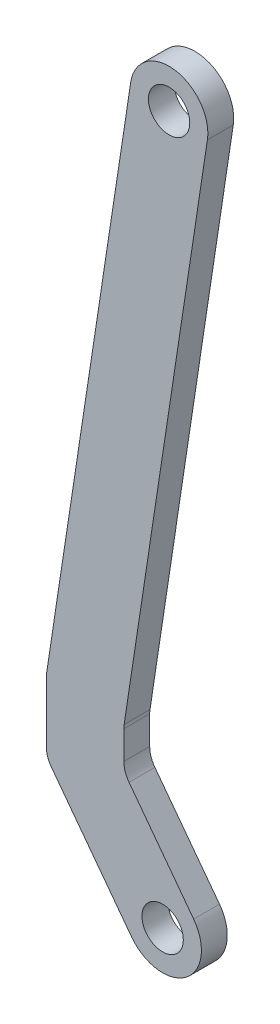
ISO-10303-21;
HEADER;
FILE_DESCRIPTION(('STEP AP214'),'2;1');
FILE_NAME('part.step','',(''),(''),'','','');
FILE_SCHEMA(('AUTOMOTIVE_DESIGN { 1 0 10303 214 1 1 1 1 }'));
ENDSEC;
DATA;
#1=APPLICATION_CONTEXT('core data for automotive mechanical design processes');
#2=APPLICATION_PROTOCOL_DEFINITION('international standard','automotive_design',2000,#1);
#3=PRODUCT_CONTEXT('',#1,'mechanical');
#4=PRODUCT('Part','Part','',(#3));
#5=PRODUCT_RELATED_PRODUCT_CATEGORY('part','',(#4));
#6=PRODUCT_DEFINITION_FORMATION('','',#4);
#7=PRODUCT_DEFINITION_CONTEXT('part definition',#1,'design');
#8=PRODUCT_DEFINITION('design','',#6,#7);
#9=PRODUCT_DEFINITION_SHAPE('','',#8);
#10=(LENGTH_UNIT() NAMED_UNIT(*) SI_UNIT(.MILLI.,.METRE.));
#11=(NAMED_UNIT(*) PLANE_ANGLE_UNIT() SI_UNIT($,.RADIAN.));
#12=(NAMED_UNIT(*) SI_UNIT($,.STERADIAN.) SOLID_ANGLE_UNIT());
#13=UNCERTAINTY_MEASURE_WITH_UNIT(LENGTH_MEASURE(1.E-05),#10,'distance_accuracy_value','');
#14=(GEOMETRIC_REPRESENTATION_CONTEXT(3) GLOBAL_UNCERTAINTY_ASSIGNED_CONTEXT((#13)) GLOBAL_UNIT_ASSIGNED_CONTEXT((#10,
#11,#12)) REPRESENTATION_CONTEXT('',''));
#15=CARTESIAN_POINT('',(0.,0.,0.));
#16=DIRECTION('',(0.,0.,1.));
#17=DIRECTION('',(1.,0.,0.));
#18=AXIS2_PLACEMENT_3D('',#15,#16,#17);
#19=CARTESIAN_POINT('',(-20.5,45.6407740281266,2.));
#20=DIRECTION('',(0.,0.,1.));
#21=DIRECTION('',(1.,0.,0.));
#22=AXIS2_PLACEMENT_3D('',#19,#20,#21);
#23=PLANE('',#22);
#24=CARTESIAN_POINT('',(-21.,-9.35695319764157,2.));
#25=DIRECTION('',(0.,0.,1.));
#26=DIRECTION('',(1.,0.,0.));
#27=AXIS2_PLACEMENT_3D('',#24,#25,#26);
#28=CIRCLE('',#27,1.6);
#29=CARTESIAN_POINT('',(-19.4,-9.35695319764157,2.));
#30=VERTEX_POINT('',#29);
#31=EDGE_CURVE('E183',#30,#30,#28,.T.);
#32=ORIENTED_EDGE('',*,*,#31,.F.);
#33=EDGE_LOOP('',(#32));
#34=FACE_BOUND('',#33,.T.);
#35=DIRECTION('',(-0.150246774783861,-0.988648525345104,0.));
#36=VECTOR('',#35,1.);
#37=CARTESIAN_POINT('',(-23.4659455760353,46.0915143524782,2.));
#38=LINE('',#37,#36);
#39=CARTESIAN_POINT('',(-23.4659455760353,46.0915143524782,2.));
#40=VERTEX_POINT('',#39);
#41=CARTESIAN_POINT('',(-29.9772970506902,3.24574915930261,2.));
#42=VERTEX_POINT('',#41);
#43=EDGE_CURVE('E158',#40,#42,#38,.T.);
#44=ORIENTED_EDGE('',*,*,#43,.T.);
#45=CARTESIAN_POINT('',(-28.,2.94525560973489,2.));
#46=DIRECTION('',(0.,0.,1.));
#47=DIRECTION('',(1.,0.,0.));
#48=AXIS2_PLACEMENT_3D('',#45,#46,#47);
#49=CIRCLE('',#48,2.);
#50=CARTESIAN_POINT('',(-30.,2.94525560973489,2.));
#51=VERTEX_POINT('',#50);
#52=EDGE_CURVE('E244',#42,#51,#49,.T.);
#53=ORIENTED_EDGE('',*,*,#52,.T.);
#54=DIRECTION('',(0.,-1.,0.));
#55=VECTOR('',#54,1.);
#56=CARTESIAN_POINT('',(-30.,3.0963600134231,2.));
#57=LINE('',#56,#55);
#58=CARTESIAN_POINT('',(-30.,-1.6902865309749,2.));
#59=VERTEX_POINT('',#58);
#60=EDGE_CURVE('E162',#51,#59,#57,.T.);
#61=ORIENTED_EDGE('',*,*,#60,.T.);
#62=CARTESIAN_POINT('',(-28.,-1.6902865309749,2.));
#63=DIRECTION('',(0.,0.,1.));
#64=DIRECTION('',(1.,0.,0.));
#65=AXIS2_PLACEMENT_3D('',#62,#63,#64);
#66=CIRCLE('',#65,2.);
#67=CARTESIAN_POINT('',(-29.6,-2.8902865309749,2.));
#68=VERTEX_POINT('',#67);
#69=EDGE_CURVE('E55',#59,#68,#66,.T.);
#70=ORIENTED_EDGE('',*,*,#69,.T.);
#71=DIRECTION('',(0.600000000000002,-0.799999999999998,0.));
#72=VECTOR('',#71,1.);
#73=CARTESIAN_POINT('',(-28.8,-3.95695319764155,2.));
#74=LINE('',#73,#72);
#75=CARTESIAN_POINT('',(-23.4,-11.1569531976416,2.));
#76=VERTEX_POINT('',#75);
#77=EDGE_CURVE('E168',#68,#76,#74,.T.);
#78=ORIENTED_EDGE('',*,*,#77,.T.);
#79=CARTESIAN_POINT('',(-21.,-9.35695319764157,2.));
#80=DIRECTION('',(0.,0.,1.));
#81=DIRECTION('',(-1.,0.,0.));
#82=AXIS2_PLACEMENT_3D('',#79,#80,#81);
#83=CIRCLE('',#82,3.);
#84=CARTESIAN_POINT('',(-18.6,-7.55695319764156,2.));
#85=VERTEX_POINT('',#84);
#86=EDGE_CURVE('E171',#76,#85,#83,.T.);
#87=ORIENTED_EDGE('',*,*,#86,.T.);
#88=DIRECTION('',(-0.6,0.8,0.));
#89=VECTOR('',#88,1.);
#90=CARTESIAN_POINT('',(-24.,-0.356953197641568,2.));
#91=LINE('',#90,#89);
#92=CARTESIAN_POINT('',(-23.6,-0.890286530974903,2.));
#93=VERTEX_POINT('',#92);
#94=EDGE_CURVE('E174',#85,#93,#91,.T.);
#95=ORIENTED_EDGE('',*,*,#94,.T.);
#96=CARTESIAN_POINT('',(-22.,0.309713469025098,2.));
#97=DIRECTION('',(0.,0.,1.));
#98=DIRECTION('',(1.,0.,0.));
#99=AXIS2_PLACEMENT_3D('',#96,#97,#98);
#100=CIRCLE('',#99,2.);
#101=CARTESIAN_POINT('',(-24.,0.309713469025098,2.));
#102=VERTEX_POINT('',#101);
#103=EDGE_CURVE('E11',#93,#102,#100,.F.);
#104=ORIENTED_EDGE('',*,*,#103,.T.);
#105=DIRECTION('',(0.,1.,0.));
#106=VECTOR('',#105,1.);
#107=CARTESIAN_POINT('',(-24.,-0.356953197641568,2.));
#108=LINE('',#107,#106);
#109=CARTESIAN_POINT('',(-24.,2.49194239867023,2.));
#110=VERTEX_POINT('',#109);
#111=EDGE_CURVE('E142',#102,#110,#108,.T.);
#112=ORIENTED_EDGE('',*,*,#111,.T.);
#113=CARTESIAN_POINT('',(-22.,2.49194239867023,2.));
#114=DIRECTION('',(0.,0.,1.));
#115=DIRECTION('',(1.,0.,0.));
#116=AXIS2_PLACEMENT_3D('',#113,#114,#115);
#117=CIRCLE('',#116,2.);
#118=CARTESIAN_POINT('',(-23.9772970506902,2.79243594823796,2.));
#119=VERTEX_POINT('',#118);
#120=EDGE_CURVE('E137',#110,#119,#117,.F.);
#121=ORIENTED_EDGE('',*,*,#120,.T.);
#122=DIRECTION('',(0.150246774783861,0.988648525345104,0.));
#123=VECTOR('',#122,1.);
#124=CARTESIAN_POINT('',(-17.5340544239647,45.190033703775,2.));
#125=LINE('',#124,#123);
#126=CARTESIAN_POINT('',(-17.5340544239647,45.190033703775,2.));
#127=VERTEX_POINT('',#126);
#128=EDGE_CURVE('E129',#119,#127,#125,.T.);
#129=ORIENTED_EDGE('',*,*,#128,.T.);
#130=CARTESIAN_POINT('',(-20.5,45.6407740281266,2.));
#131=DIRECTION('',(0.,0.,1.));
#132=DIRECTION('',(1.,0.,0.));
#133=AXIS2_PLACEMENT_3D('',#130,#131,#132);
#134=CIRCLE('',#133,3.);
#135=EDGE_CURVE('E133',#127,#40,#134,.T.);
#136=ORIENTED_EDGE('',*,*,#135,.T.);
#137=EDGE_LOOP('',(#44,#53,#61,#70,#78,#87,#95,#104,#112,#121,#129,#136));
#138=FACE_BOUND('',#137,.T.);
#139=CARTESIAN_POINT('',(-20.5,45.6407740281266,2.));
#140=DIRECTION('',(0.,0.,1.));
#141=DIRECTION('',(1.,0.,0.));
#142=AXIS2_PLACEMENT_3D('',#139,#140,#141);
#143=CIRCLE('',#142,1.6);
#144=CARTESIAN_POINT('',(-18.9,45.6407740281266,2.));
#145=VERTEX_POINT('',#144);
#146=EDGE_CURVE('E284',#145,#145,#143,.T.);
#147=ORIENTED_EDGE('',*,*,#146,.F.);
#148=EDGE_LOOP('',(#147));
#149=FACE_BOUND('',#148,.T.);
#150=ADVANCED_FACE('F39',(#34,#138,#149),#23,.T.);
#151=CARTESIAN_POINT('',(-20.5,45.6407740281266,0.));
#152=DIRECTION('',(0.,0.,1.));
#153=DIRECTION('',(1.,0.,0.));
#154=AXIS2_PLACEMENT_3D('',#151,#152,#153);
#155=PLANE('',#154);
#156=DIRECTION('',(0.,-1.,0.));
#157=VECTOR('',#156,1.);
#158=CARTESIAN_POINT('',(-30.,3.0963600134231,0.));
#159=LINE('',#158,#157);
#160=CARTESIAN_POINT('',(-30.,2.94525560973489,0.));
#161=VERTEX_POINT('',#160);
#162=CARTESIAN_POINT('',(-30.,-1.6902865309749,0.));
#163=VERTEX_POINT('',#162);
#164=EDGE_CURVE('E192',#161,#163,#159,.T.);
#165=ORIENTED_EDGE('',*,*,#164,.F.);
#166=CARTESIAN_POINT('',(-28.,2.94525560973489,0.));
#167=DIRECTION('',(0.,0.,1.));
#168=DIRECTION('',(1.,0.,0.));
#169=AXIS2_PLACEMENT_3D('',#166,#167,#168);
#170=CIRCLE('',#169,2.);
#171=CARTESIAN_POINT('',(-29.9772970506902,3.24574915930261,0.));
#172=VERTEX_POINT('',#171);
#173=EDGE_CURVE('E237',#161,#172,#170,.F.);
#174=ORIENTED_EDGE('',*,*,#173,.T.);
#175=DIRECTION('',(-0.150246774783861,-0.988648525345104,0.));
#176=VECTOR('',#175,1.);
#177=CARTESIAN_POINT('',(-23.4659455760353,46.0915143524782,0.));
#178=LINE('',#177,#176);
#179=CARTESIAN_POINT('',(-23.4659455760353,46.0915143524782,0.));
#180=VERTEX_POINT('',#179);
#181=EDGE_CURVE('E189',#180,#172,#178,.T.);
#182=ORIENTED_EDGE('',*,*,#181,.F.);
#183=CARTESIAN_POINT('',(-20.5,45.6407740281266,0.));
#184=DIRECTION('',(0.,0.,1.));
#185=DIRECTION('',(1.,0.,0.));
#186=AXIS2_PLACEMENT_3D('',#183,#184,#185);
#187=CIRCLE('',#186,3.);
#188=CARTESIAN_POINT('',(-17.5340544239647,45.190033703775,0.));
#189=VERTEX_POINT('',#188);
#190=EDGE_CURVE('E186',#189,#180,#187,.T.);
#191=ORIENTED_EDGE('',*,*,#190,.F.);
#192=DIRECTION('',(0.150246774783861,0.988648525345104,0.));
#193=VECTOR('',#192,1.);
#194=CARTESIAN_POINT('',(-17.5340544239647,45.190033703775,0.));
#195=LINE('',#194,#193);
#196=CARTESIAN_POINT('',(-23.9772970506902,2.79243594823796,0.));
#197=VERTEX_POINT('',#196);
#198=EDGE_CURVE('E148',#197,#189,#195,.T.);
#199=ORIENTED_EDGE('',*,*,#198,.F.);
#200=CARTESIAN_POINT('',(-22.,2.49194239867023,0.));
#201=DIRECTION('',(0.,0.,1.));
#202=DIRECTION('',(1.,0.,0.));
#203=AXIS2_PLACEMENT_3D('',#200,#201,#202);
#204=CIRCLE('',#203,2.);
#205=CARTESIAN_POINT('',(-24.,2.49194239867023,0.));
#206=VERTEX_POINT('',#205);
#207=EDGE_CURVE('E251',#197,#206,#204,.T.);
#208=ORIENTED_EDGE('',*,*,#207,.T.);
#209=DIRECTION('',(0.,1.,0.));
#210=VECTOR('',#209,1.);
#211=CARTESIAN_POINT('',(-24.,-0.356953197641568,0.));
#212=LINE('',#211,#210);
#213=CARTESIAN_POINT('',(-24.,0.309713469025098,0.));
#214=VERTEX_POINT('',#213);
#215=EDGE_CURVE('E179',#214,#206,#212,.T.);
#216=ORIENTED_EDGE('',*,*,#215,.F.);
#217=CARTESIAN_POINT('',(-22.,0.309713469025098,0.));
#218=DIRECTION('',(0.,0.,1.));
#219=DIRECTION('',(1.,0.,0.));
#220=AXIS2_PLACEMENT_3D('',#217,#218,#219);
#221=CIRCLE('',#220,2.);
#222=CARTESIAN_POINT('',(-23.6,-0.890286530974903,0.));
#223=VERTEX_POINT('',#222);
#224=EDGE_CURVE('E48',#214,#223,#221,.T.);
#225=ORIENTED_EDGE('',*,*,#224,.T.);
#226=DIRECTION('',(-0.6,0.8,0.));
#227=VECTOR('',#226,1.);
#228=CARTESIAN_POINT('',(-24.,-0.356953197641568,0.));
#229=LINE('',#228,#227);
#230=CARTESIAN_POINT('',(-18.6,-7.55695319764156,0.));
#231=VERTEX_POINT('',#230);
#232=EDGE_CURVE('E202',#231,#223,#229,.T.);
#233=ORIENTED_EDGE('',*,*,#232,.F.);
#234=CARTESIAN_POINT('',(-21.,-9.35695319764157,0.));
#235=DIRECTION('',(0.,0.,1.));
#236=DIRECTION('',(-1.,0.,0.));
#237=AXIS2_PLACEMENT_3D('',#234,#235,#236);
#238=CIRCLE('',#237,3.);
#239=CARTESIAN_POINT('',(-23.4,-11.1569531976416,0.));
#240=VERTEX_POINT('',#239);
#241=EDGE_CURVE('E199',#240,#231,#238,.T.);
#242=ORIENTED_EDGE('',*,*,#241,.F.);
#243=DIRECTION('',(0.6,-0.8,0.));
#244=VECTOR('',#243,1.);
#245=CARTESIAN_POINT('',(-23.4,-11.1569531976416,0.));
#246=LINE('',#245,#244);
#247=CARTESIAN_POINT('',(-29.6,-2.8902865309749,0.));
#248=VERTEX_POINT('',#247);
#249=EDGE_CURVE('E196',#248,#240,#246,.T.);
#250=ORIENTED_EDGE('',*,*,#249,.F.);
#251=CARTESIAN_POINT('',(-28.,-1.6902865309749,0.));
#252=DIRECTION('',(0.,0.,1.));
#253=DIRECTION('',(1.,0.,0.));
#254=AXIS2_PLACEMENT_3D('',#251,#252,#253);
#255=CIRCLE('',#254,2.);
#256=EDGE_CURVE('E234',#248,#163,#255,.F.);
#257=ORIENTED_EDGE('',*,*,#256,.T.);
#258=EDGE_LOOP('',(#165,#174,#182,#191,#199,#208,#216,#225,#233,#242,#250,#257));
#259=FACE_BOUND('',#258,.T.);
#260=CARTESIAN_POINT('',(-21.,-9.35695319764157,0.));
#261=DIRECTION('',(0.,0.,1.));
#262=DIRECTION('',(1.,0.,0.));
#263=AXIS2_PLACEMENT_3D('',#260,#261,#262);
#264=CIRCLE('',#263,1.6);
#265=CARTESIAN_POINT('',(-19.4,-9.35695319764157,0.));
#266=VERTEX_POINT('',#265);
#267=EDGE_CURVE('E280',#266,#266,#264,.T.);
#268=ORIENTED_EDGE('',*,*,#267,.T.);
#269=EDGE_LOOP('',(#268));
#270=FACE_BOUND('',#269,.T.);
#271=CARTESIAN_POINT('',(-20.5,45.6407740281266,0.));
#272=DIRECTION('',(0.,0.,1.));
#273=DIRECTION('',(1.,0.,0.));
#274=AXIS2_PLACEMENT_3D('',#271,#272,#273);
#275=CIRCLE('',#274,1.6);
#276=CARTESIAN_POINT('',(-18.9,45.6407740281266,0.));
#277=VERTEX_POINT('',#276);
#278=EDGE_CURVE('E288',#277,#277,#275,.T.);
#279=ORIENTED_EDGE('',*,*,#278,.T.);
#280=EDGE_LOOP('',(#279));
#281=FACE_BOUND('',#280,.T.);
#282=ADVANCED_FACE('F261',(#259,#270,#281),#155,.F.);
#283=CARTESIAN_POINT('',(-24.,-0.356953197641568,2.));
#284=DIRECTION('',(-1.,0.,0.));
#285=DIRECTION('',(0.,0.,1.));
#286=AXIS2_PLACEMENT_3D('',#283,#284,#285);
#287=PLANE('',#286);
#288=ORIENTED_EDGE('',*,*,#215,.T.);
#289=DIRECTION('',(0.,0.,-1.));
#290=VECTOR('',#289,1.);
#291=CARTESIAN_POINT('',(-24.,2.49194239867023,2.));
#292=LINE('',#291,#290);
#293=EDGE_CURVE('E221',#206,#110,#292,.F.);
#294=ORIENTED_EDGE('',*,*,#293,.T.);
#295=ORIENTED_EDGE('',*,*,#111,.F.);
#296=DIRECTION('',(0.,0.,-1.));
#297=VECTOR('',#296,1.);
#298=CARTESIAN_POINT('',(-24.,0.309713469025098,0.));
#299=LINE('',#298,#297);
#300=EDGE_CURVE('E217',#102,#214,#299,.T.);
#301=ORIENTED_EDGE('',*,*,#300,.T.);
#302=EDGE_LOOP('',(#288,#294,#295,#301));
#303=FACE_BOUND('',#302,.T.);
#304=ADVANCED_FACE('F275',(#303),#287,.F.);
#305=CARTESIAN_POINT('',(-17.5340544239647,45.190033703775,2.));
#306=DIRECTION('',(-0.988648525345104,0.150246774783861,0.));
#307=DIRECTION('',(-0.150246774783861,-0.988648525345104,0.));
#308=AXIS2_PLACEMENT_3D('',#305,#306,#307);
#309=PLANE('',#308);
#310=ORIENTED_EDGE('',*,*,#128,.F.);
#311=DIRECTION('',(0.,0.,-1.));
#312=VECTOR('',#311,1.);
#313=CARTESIAN_POINT('',(-23.9772970506902,2.79243594823795,0.));
#314=LINE('',#313,#312);
#315=EDGE_CURVE('E152',#119,#197,#314,.T.);
#316=ORIENTED_EDGE('',*,*,#315,.T.);
#317=ORIENTED_EDGE('',*,*,#198,.T.);
#318=DIRECTION('',(0.,0.,-1.));
#319=VECTOR('',#318,1.);
#320=CARTESIAN_POINT('',(-17.5340544239647,45.190033703775,2.));
#321=LINE('',#320,#319);
#322=EDGE_CURVE('E145',#127,#189,#321,.T.);
#323=ORIENTED_EDGE('',*,*,#322,.F.);
#324=EDGE_LOOP('',(#310,#316,#317,#323));
#325=FACE_BOUND('',#324,.T.);
#326=ADVANCED_FACE('F146',(#325),#309,.F.);
#327=CARTESIAN_POINT('',(-20.5,45.6407740281266,2.));
#328=DIRECTION('',(0.,0.,-1.));
#329=DIRECTION('',(-1.,0.,0.));
#330=AXIS2_PLACEMENT_3D('',#327,#328,#329);
#331=CYLINDRICAL_SURFACE('',#330,3.);
#332=ORIENTED_EDGE('',*,*,#190,.T.);
#333=DIRECTION('',(0.,0.,-1.));
#334=VECTOR('',#333,1.);
#335=CARTESIAN_POINT('',(-23.4659455760353,46.0915143524782,2.));
#336=LINE('',#335,#334);
#337=EDGE_CURVE('E153',#40,#180,#336,.T.);
#338=ORIENTED_EDGE('',*,*,#337,.F.);
#339=ORIENTED_EDGE('',*,*,#135,.F.);
#340=ORIENTED_EDGE('',*,*,#322,.T.);
#341=EDGE_LOOP('',(#332,#338,#339,#340));
#342=FACE_BOUND('',#341,.T.);
#343=ADVANCED_FACE('F155',(#342),#331,.T.);
#344=CARTESIAN_POINT('',(-23.4659455760353,46.0915143524782,2.));
#345=DIRECTION('',(0.988648525345104,-0.150246774783861,0.));
#346=DIRECTION('',(0.150246774783861,0.988648525345104,0.));
#347=AXIS2_PLACEMENT_3D('',#344,#345,#346);
#348=PLANE('',#347);
#349=ORIENTED_EDGE('',*,*,#181,.T.);
#350=DIRECTION('',(0.,0.,-1.));
#351=VECTOR('',#350,1.);
#352=CARTESIAN_POINT('',(-29.9772970506902,3.24574915930261,2.));
#353=LINE('',#352,#351);
#354=EDGE_CURVE('E63',#172,#42,#353,.F.);
#355=ORIENTED_EDGE('',*,*,#354,.T.);
#356=ORIENTED_EDGE('',*,*,#43,.F.);
#357=ORIENTED_EDGE('',*,*,#337,.T.);
#358=EDGE_LOOP('',(#349,#355,#356,#357));
#359=FACE_BOUND('',#358,.T.);
#360=ADVANCED_FACE('F324',(#359),#348,.F.);
#361=CARTESIAN_POINT('',(-30.,3.0963600134231,2.));
#362=DIRECTION('',(1.,0.,0.));
#363=DIRECTION('',(0.,0.,-1.));
#364=AXIS2_PLACEMENT_3D('',#361,#362,#363);
#365=PLANE('',#364);
#366=ORIENTED_EDGE('',*,*,#60,.F.);
#367=DIRECTION('',(0.,0.,-1.));
#368=VECTOR('',#367,1.);
#369=CARTESIAN_POINT('',(-30.,2.94525560973489,2.));
#370=LINE('',#369,#368);
#371=EDGE_CURVE('E230',#51,#161,#370,.T.);
#372=ORIENTED_EDGE('',*,*,#371,.T.);
#373=ORIENTED_EDGE('',*,*,#164,.T.);
#374=DIRECTION('',(0.,0.,-1.));
#375=VECTOR('',#374,1.);
#376=CARTESIAN_POINT('',(-30.,-1.6902865309749,2.));
#377=LINE('',#376,#375);
#378=EDGE_CURVE('E227',#163,#59,#377,.F.);
#379=ORIENTED_EDGE('',*,*,#378,.T.);
#380=EDGE_LOOP('',(#366,#372,#373,#379));
#381=FACE_BOUND('',#380,.T.);
#382=ADVANCED_FACE('F320',(#381),#365,.F.);
#383=CARTESIAN_POINT('',(-23.4,-11.1569531976416,2.));
#384=DIRECTION('',(0.8,0.6,0.));
#385=DIRECTION('',(-0.6,0.8,0.));
#386=AXIS2_PLACEMENT_3D('',#383,#384,#385);
#387=PLANE('',#386);
#388=ORIENTED_EDGE('',*,*,#77,.F.);
#389=DIRECTION('',(0.,0.,-1.));
#390=VECTOR('',#389,1.);
#391=CARTESIAN_POINT('',(-29.6,-2.8902865309749,2.));
#392=LINE('',#391,#390);
#393=EDGE_CURVE('E247',#68,#248,#392,.T.);
#394=ORIENTED_EDGE('',*,*,#393,.T.);
#395=ORIENTED_EDGE('',*,*,#249,.T.);
#396=DIRECTION('',(0.,0.,-1.));
#397=VECTOR('',#396,1.);
#398=CARTESIAN_POINT('',(-23.4,-11.1569531976416,2.));
#399=LINE('',#398,#397);
#400=EDGE_CURVE('E209',#76,#240,#399,.T.);
#401=ORIENTED_EDGE('',*,*,#400,.F.);
#402=EDGE_LOOP('',(#388,#394,#395,#401));
#403=FACE_BOUND('',#402,.T.);
#404=ADVANCED_FACE('F316',(#403),#387,.F.);
#405=CARTESIAN_POINT('',(-21.,-9.35695319764157,2.));
#406=DIRECTION('',(0.,0.,-1.));
#407=DIRECTION('',(-1.,0.,0.));
#408=AXIS2_PLACEMENT_3D('',#405,#406,#407);
#409=CYLINDRICAL_SURFACE('',#408,3.);
#410=ORIENTED_EDGE('',*,*,#241,.T.);
#411=DIRECTION('',(0.,0.,-1.));
#412=VECTOR('',#411,1.);
#413=CARTESIAN_POINT('',(-18.6,-7.55695319764156,2.));
#414=LINE('',#413,#412);
#415=EDGE_CURVE('E178',#85,#231,#414,.T.);
#416=ORIENTED_EDGE('',*,*,#415,.F.);
#417=ORIENTED_EDGE('',*,*,#86,.F.);
#418=ORIENTED_EDGE('',*,*,#400,.T.);
#419=EDGE_LOOP('',(#410,#416,#417,#418));
#420=FACE_BOUND('',#419,.T.);
#421=ADVANCED_FACE('F313',(#420),#409,.T.);
#422=CARTESIAN_POINT('',(-24.,-0.356953197641568,2.));
#423=DIRECTION('',(-0.8,-0.6,0.));
#424=DIRECTION('',(0.6,-0.8,0.));
#425=AXIS2_PLACEMENT_3D('',#422,#423,#424);
#426=PLANE('',#425);
#427=ORIENTED_EDGE('',*,*,#232,.T.);
#428=DIRECTION('',(0.,0.,-1.));
#429=VECTOR('',#428,1.);
#430=CARTESIAN_POINT('',(-23.6,-0.890286530974903,2.));
#431=LINE('',#430,#429);
#432=EDGE_CURVE('E224',#223,#93,#431,.F.);
#433=ORIENTED_EDGE('',*,*,#432,.T.);
#434=ORIENTED_EDGE('',*,*,#94,.F.);
#435=ORIENTED_EDGE('',*,*,#415,.T.);
#436=EDGE_LOOP('',(#427,#433,#434,#435));
#437=FACE_BOUND('',#436,.T.);
#438=ADVANCED_FACE('F268',(#437),#426,.F.);
#439=CARTESIAN_POINT('',(-21.,-9.35695319764157,2.));
#440=DIRECTION('',(0.,0.,-1.));
#441=DIRECTION('',(-1.,0.,0.));
#442=AXIS2_PLACEMENT_3D('',#439,#440,#441);
#443=CYLINDRICAL_SURFACE('',#442,1.6);
#444=ORIENTED_EDGE('',*,*,#31,.T.);
#445=EDGE_LOOP('',(#444));
#446=FACE_BOUND('',#445,.T.);
#447=ORIENTED_EDGE('',*,*,#267,.F.);
#448=EDGE_LOOP('',(#447));
#449=FACE_BOUND('',#448,.T.);
#450=ADVANCED_FACE('F308',(#446,#449),#443,.F.);
#451=CARTESIAN_POINT('',(-20.5,45.6407740281266,2.));
#452=DIRECTION('',(0.,0.,-1.));
#453=DIRECTION('',(-1.,0.,0.));
#454=AXIS2_PLACEMENT_3D('',#451,#452,#453);
#455=CYLINDRICAL_SURFACE('',#454,1.6);
#456=ORIENTED_EDGE('',*,*,#146,.T.);
#457=EDGE_LOOP('',(#456));
#458=FACE_BOUND('',#457,.T.);
#459=ORIENTED_EDGE('',*,*,#278,.F.);
#460=EDGE_LOOP('',(#459));
#461=FACE_BOUND('',#460,.T.);
#462=ADVANCED_FACE('F297',(#458,#461),#455,.F.);
#463=CARTESIAN_POINT('',(-22.,2.49194239867023,2.));
#464=DIRECTION('',(0.,0.,1.));
#465=DIRECTION('',(1.,0.,0.));
#466=AXIS2_PLACEMENT_3D('',#463,#464,#465);
#467=CYLINDRICAL_SURFACE('',#466,2.);
#468=ORIENTED_EDGE('',*,*,#120,.F.);
#469=ORIENTED_EDGE('',*,*,#293,.F.);
#470=ORIENTED_EDGE('',*,*,#207,.F.);
#471=ORIENTED_EDGE('',*,*,#315,.F.);
#472=EDGE_LOOP('',(#468,#469,#470,#471));
#473=FACE_BOUND('',#472,.T.);
#474=ADVANCED_FACE('F334',(#473),#467,.F.);
#475=CARTESIAN_POINT('',(-22.,0.309713469025098,2.));
#476=DIRECTION('',(0.,0.,1.));
#477=DIRECTION('',(1.,0.,0.));
#478=AXIS2_PLACEMENT_3D('',#475,#476,#477);
#479=CYLINDRICAL_SURFACE('',#478,2.);
#480=ORIENTED_EDGE('',*,*,#103,.F.);
#481=ORIENTED_EDGE('',*,*,#432,.F.);
#482=ORIENTED_EDGE('',*,*,#224,.F.);
#483=ORIENTED_EDGE('',*,*,#300,.F.);
#484=EDGE_LOOP('',(#480,#481,#482,#483));
#485=FACE_BOUND('',#484,.T.);
#486=ADVANCED_FACE('F272',(#485),#479,.F.);
#487=CARTESIAN_POINT('',(-28.,2.94525560973489,2.));
#488=DIRECTION('',(0.,0.,-1.));
#489=DIRECTION('',(-1.,0.,0.));
#490=AXIS2_PLACEMENT_3D('',#487,#488,#489);
#491=CYLINDRICAL_SURFACE('',#490,2.);
#492=ORIENTED_EDGE('',*,*,#52,.F.);
#493=ORIENTED_EDGE('',*,*,#354,.F.);
#494=ORIENTED_EDGE('',*,*,#173,.F.);
#495=ORIENTED_EDGE('',*,*,#371,.F.);
#496=EDGE_LOOP('',(#492,#493,#494,#495));
#497=FACE_BOUND('',#496,.T.);
#498=ADVANCED_FACE('F339',(#497),#491,.T.);
#499=CARTESIAN_POINT('',(-28.,-1.6902865309749,2.));
#500=DIRECTION('',(0.,0.,-1.));
#501=DIRECTION('',(-1.,0.,0.));
#502=AXIS2_PLACEMENT_3D('',#499,#500,#501);
#503=CYLINDRICAL_SURFACE('',#502,2.);
#504=ORIENTED_EDGE('',*,*,#69,.F.);
#505=ORIENTED_EDGE('',*,*,#378,.F.);
#506=ORIENTED_EDGE('',*,*,#256,.F.);
#507=ORIENTED_EDGE('',*,*,#393,.F.);
#508=EDGE_LOOP('',(#504,#505,#506,#507));
#509=FACE_BOUND('',#508,.T.);
#510=ADVANCED_FACE('F41',(#509),#503,.T.);
#511=CLOSED_SHELL('',(#150,#282,#304,#326,#343,#360,#382,#404,#421,#438,#450,#462,#474,#486,
#498,#510));
#512=MANIFOLD_SOLID_BREP('B2',#511);
#513=ADVANCED_BREP_SHAPE_REPRESENTATION('',(#18,#512),#14);
#514=SHAPE_DEFINITION_REPRESENTATION(#9,#513);
ENDSEC;
END-ISO-10303-21;
